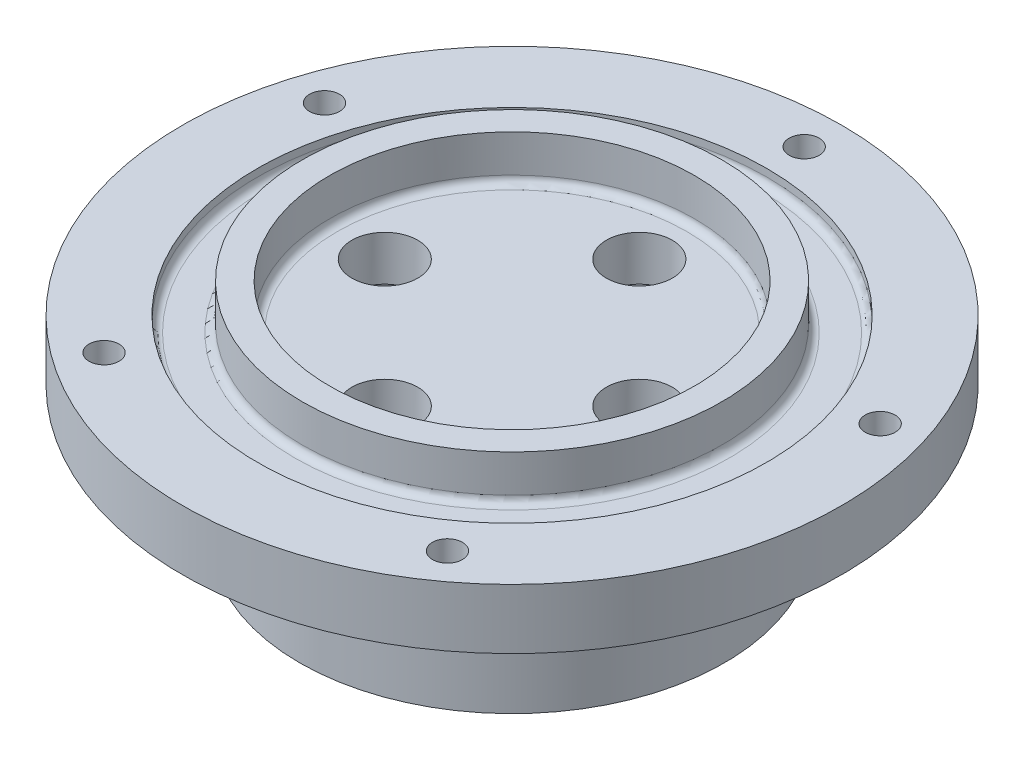
ISO-10303-21;
HEADER;
FILE_DESCRIPTION(('STEP AP214'),'2;1');
FILE_NAME('part.step','',(''),(''),'','','');
FILE_SCHEMA(('AUTOMOTIVE_DESIGN { 1 0 10303 214 1 1 1 1 }'));
ENDSEC;
DATA;
#1=APPLICATION_CONTEXT('core data for automotive mechanical design processes');
#2=APPLICATION_PROTOCOL_DEFINITION('international standard','automotive_design',2000,#1);
#3=PRODUCT_CONTEXT('',#1,'mechanical');
#4=PRODUCT('Part','Part','',(#3));
#5=PRODUCT_RELATED_PRODUCT_CATEGORY('part','',(#4));
#6=PRODUCT_DEFINITION_FORMATION('','',#4);
#7=PRODUCT_DEFINITION_CONTEXT('part definition',#1,'design');
#8=PRODUCT_DEFINITION('design','',#6,#7);
#9=PRODUCT_DEFINITION_SHAPE('','',#8);
#10=(LENGTH_UNIT() NAMED_UNIT(*) SI_UNIT(.MILLI.,.METRE.));
#11=(NAMED_UNIT(*) PLANE_ANGLE_UNIT() SI_UNIT($,.RADIAN.));
#12=(NAMED_UNIT(*) SI_UNIT($,.STERADIAN.) SOLID_ANGLE_UNIT());
#13=UNCERTAINTY_MEASURE_WITH_UNIT(LENGTH_MEASURE(1.E-05),#10,'distance_accuracy_value','');
#14=(GEOMETRIC_REPRESENTATION_CONTEXT(3) GLOBAL_UNCERTAINTY_ASSIGNED_CONTEXT((#13)) GLOBAL_UNIT_ASSIGNED_CONTEXT((#10,
#11,#12)) REPRESENTATION_CONTEXT('',''));
#15=CARTESIAN_POINT('',(0.,0.,0.));
#16=DIRECTION('',(0.,0.,1.));
#17=DIRECTION('',(1.,0.,0.));
#18=AXIS2_PLACEMENT_3D('',#15,#16,#17);
#19=CARTESIAN_POINT('',(-22.51075,-14.2875,-1.57191727096726E-13));
#20=DIRECTION('',(0.,-1.,0.));
#21=DIRECTION('',(0.,0.,-1.));
#22=AXIS2_PLACEMENT_3D('',#19,#20,#21);
#23=PLANE('',#22);
#24=CARTESIAN_POINT('',(0.,-14.2875,0.));
#25=DIRECTION('',(0.,-1.,0.));
#26=DIRECTION('',(0.,0.,-1.));
#27=AXIS2_PLACEMENT_3D('',#24,#25,#26);
#28=CIRCLE('',#27,22.51075);
#29=CARTESIAN_POINT('',(0.,-14.2875,-22.51075));
#30=VERTEX_POINT('',#29);
#31=EDGE_CURVE('E131',#30,#30,#28,.T.);
#32=ORIENTED_EDGE('',*,*,#31,.T.);
#33=EDGE_LOOP('',(#32));
#34=FACE_BOUND('',#33,.T.);
#35=CARTESIAN_POINT('',(0.,-14.2875,0.));
#36=DIRECTION('',(0.,-1.,0.));
#37=DIRECTION('',(0.,0.,-1.));
#38=AXIS2_PLACEMENT_3D('',#35,#36,#37);
#39=CIRCLE('',#38,19.33575);
#40=CARTESIAN_POINT('',(0.,-14.2875,-19.33575));
#41=VERTEX_POINT('',#40);
#42=EDGE_CURVE('E78',#41,#41,#39,.T.);
#43=ORIENTED_EDGE('',*,*,#42,.F.);
#44=EDGE_LOOP('',(#43));
#45=FACE_BOUND('',#44,.T.);
#46=ADVANCED_FACE('F36',(#34,#45),#23,.T.);
#47=CARTESIAN_POINT('',(0.,0.,0.));
#48=DIRECTION('',(0.,-1.,0.));
#49=DIRECTION('',(0.,0.,-1.));
#50=AXIS2_PLACEMENT_3D('',#47,#48,#49);
#51=CYLINDRICAL_SURFACE('',#50,19.33575);
#52=CARTESIAN_POINT('',(0.,-0.79375,0.));
#53=DIRECTION('',(0.,-1.,0.));
#54=DIRECTION('',(0.,0.,-1.));
#55=AXIS2_PLACEMENT_3D('',#52,#53,#54);
#56=CIRCLE('',#55,19.33575);
#57=CARTESIAN_POINT('',(0.,-0.79375,-19.33575));
#58=VERTEX_POINT('',#57);
#59=EDGE_CURVE('E70',#58,#58,#56,.F.);
#60=ORIENTED_EDGE('',*,*,#59,.T.);
#61=EDGE_LOOP('',(#60));
#62=FACE_BOUND('',#61,.T.);
#63=ORIENTED_EDGE('',*,*,#42,.T.);
#64=EDGE_LOOP('',(#63));
#65=FACE_BOUND('',#64,.T.);
#66=ADVANCED_FACE('F222',(#62,#65),#51,.F.);
#67=CARTESIAN_POINT('',(-19.33575,0.,-1.35020820595072E-13));
#68=DIRECTION('',(0.,-1.,0.));
#69=DIRECTION('',(0.,0.,-1.));
#70=AXIS2_PLACEMENT_3D('',#67,#68,#69);
#71=PLANE('',#70);
#72=CARTESIAN_POINT('',(0.,0.,0.));
#73=DIRECTION('',(0.,-1.,0.));
#74=DIRECTION('',(0.,0.,-1.));
#75=AXIS2_PLACEMENT_3D('',#72,#73,#74);
#76=CIRCLE('',#75,18.542);
#77=CARTESIAN_POINT('',(0.,0.,-18.542));
#78=VERTEX_POINT('',#77);
#79=EDGE_CURVE('E74',#78,#78,#76,.T.);
#80=ORIENTED_EDGE('',*,*,#79,.T.);
#81=EDGE_LOOP('',(#80));
#82=FACE_BOUND('',#81,.T.);
#83=CARTESIAN_POINT('',(0.,0.,-13.4874));
#84=DIRECTION('',(0.,-1.,0.));
#85=DIRECTION('',(0.,0.,-1.));
#86=AXIS2_PLACEMENT_3D('',#83,#84,#85);
#87=CIRCLE('',#86,3.4925);
#88=CARTESIAN_POINT('',(0.,0.,-16.9799));
#89=VERTEX_POINT('',#88);
#90=EDGE_CURVE('E158',#89,#89,#87,.T.);
#91=ORIENTED_EDGE('',*,*,#90,.F.);
#92=EDGE_LOOP('',(#91));
#93=FACE_BOUND('',#92,.T.);
#94=CARTESIAN_POINT('',(13.4874,0.,0.));
#95=DIRECTION('',(0.,-1.,0.));
#96=DIRECTION('',(0.,0.,-1.));
#97=AXIS2_PLACEMENT_3D('',#94,#95,#96);
#98=CIRCLE('',#97,3.4925);
#99=CARTESIAN_POINT('',(13.4874,0.,-3.4925));
#100=VERTEX_POINT('',#99);
#101=EDGE_CURVE('E150',#100,#100,#98,.T.);
#102=ORIENTED_EDGE('',*,*,#101,.F.);
#103=EDGE_LOOP('',(#102));
#104=FACE_BOUND('',#103,.T.);
#105=CARTESIAN_POINT('',(0.,0.,13.4874));
#106=DIRECTION('',(0.,-1.,0.));
#107=DIRECTION('',(0.,0.,-1.));
#108=AXIS2_PLACEMENT_3D('',#105,#106,#107);
#109=CIRCLE('',#108,3.4925);
#110=CARTESIAN_POINT('',(0.,0.,9.9949));
#111=VERTEX_POINT('',#110);
#112=EDGE_CURVE('E143',#111,#111,#109,.T.);
#113=ORIENTED_EDGE('',*,*,#112,.F.);
#114=EDGE_LOOP('',(#113));
#115=FACE_BOUND('',#114,.T.);
#116=CARTESIAN_POINT('',(-13.4874,0.,0.));
#117=DIRECTION('',(0.,-1.,0.));
#118=DIRECTION('',(0.,0.,-1.));
#119=AXIS2_PLACEMENT_3D('',#116,#117,#118);
#120=CIRCLE('',#119,3.4925);
#121=CARTESIAN_POINT('',(-13.4874,0.,-3.4925));
#122=VERTEX_POINT('',#121);
#123=EDGE_CURVE('E135',#122,#122,#120,.T.);
#124=ORIENTED_EDGE('',*,*,#123,.F.);
#125=EDGE_LOOP('',(#124));
#126=FACE_BOUND('',#125,.T.);
#127=ADVANCED_FACE('F227',(#82,#93,#104,#115,#126),#71,.T.);
#128=CARTESIAN_POINT('',(0.,4.7625,0.));
#129=DIRECTION('',(0.,1.,0.));
#130=DIRECTION('',(0.,0.,1.));
#131=AXIS2_PLACEMENT_3D('',#128,#129,#130);
#132=PLANE('',#131);
#133=CARTESIAN_POINT('',(0.,4.7625,0.));
#134=DIRECTION('',(0.,1.,0.));
#135=DIRECTION('',(0.,0.,1.));
#136=AXIS2_PLACEMENT_3D('',#133,#134,#135);
#137=CIRCLE('',#136,18.542);
#138=CARTESIAN_POINT('',(0.,4.7625,18.542));
#139=VERTEX_POINT('',#138);
#140=EDGE_CURVE('E62',#139,#139,#137,.T.);
#141=ORIENTED_EDGE('',*,*,#140,.T.);
#142=EDGE_LOOP('',(#141));
#143=FACE_BOUND('',#142,.T.);
#144=CARTESIAN_POINT('',(0.,4.7625,-13.4874));
#145=DIRECTION('',(0.,1.,0.));
#146=DIRECTION('',(0.,0.,1.));
#147=AXIS2_PLACEMENT_3D('',#144,#145,#146);
#148=CIRCLE('',#147,3.4925);
#149=CARTESIAN_POINT('',(0.,4.7625,-9.9949));
#150=VERTEX_POINT('',#149);
#151=EDGE_CURVE('E104',#150,#150,#148,.T.);
#152=ORIENTED_EDGE('',*,*,#151,.F.);
#153=EDGE_LOOP('',(#152));
#154=FACE_BOUND('',#153,.T.);
#155=CARTESIAN_POINT('',(13.4874,4.7625,0.));
#156=DIRECTION('',(0.,1.,0.));
#157=DIRECTION('',(0.,0.,1.));
#158=AXIS2_PLACEMENT_3D('',#155,#156,#157);
#159=CIRCLE('',#158,3.4925);
#160=CARTESIAN_POINT('',(13.4874,4.7625,3.4925));
#161=VERTEX_POINT('',#160);
#162=EDGE_CURVE('E154',#161,#161,#159,.T.);
#163=ORIENTED_EDGE('',*,*,#162,.F.);
#164=EDGE_LOOP('',(#163));
#165=FACE_BOUND('',#164,.T.);
#166=CARTESIAN_POINT('',(0.,4.7625,13.4874));
#167=DIRECTION('',(0.,1.,0.));
#168=DIRECTION('',(0.,0.,1.));
#169=AXIS2_PLACEMENT_3D('',#166,#167,#168);
#170=CIRCLE('',#169,3.4925);
#171=CARTESIAN_POINT('',(0.,4.7625,16.9799));
#172=VERTEX_POINT('',#171);
#173=EDGE_CURVE('E147',#172,#172,#170,.T.);
#174=ORIENTED_EDGE('',*,*,#173,.F.);
#175=EDGE_LOOP('',(#174));
#176=FACE_BOUND('',#175,.T.);
#177=CARTESIAN_POINT('',(-13.4874,4.7625,0.));
#178=DIRECTION('',(0.,1.,0.));
#179=DIRECTION('',(0.,0.,1.));
#180=AXIS2_PLACEMENT_3D('',#177,#178,#179);
#181=CIRCLE('',#180,3.4925);
#182=CARTESIAN_POINT('',(-13.4874,4.7625,3.4925));
#183=VERTEX_POINT('',#182);
#184=EDGE_CURVE('E139',#183,#183,#181,.T.);
#185=ORIENTED_EDGE('',*,*,#184,.F.);
#186=EDGE_LOOP('',(#185));
#187=FACE_BOUND('',#186,.T.);
#188=ADVANCED_FACE('F233',(#143,#154,#165,#176,#187),#132,.T.);
#189=CARTESIAN_POINT('',(0.,0.,0.));
#190=DIRECTION('',(0.,-1.,0.));
#191=DIRECTION('',(0.,0.,-1.));
#192=AXIS2_PLACEMENT_3D('',#189,#190,#191);
#193=CYLINDRICAL_SURFACE('',#192,19.33575);
#194=CARTESIAN_POINT('',(0.,5.55625,0.));
#195=DIRECTION('',(0.,1.,0.));
#196=DIRECTION('',(0.,0.,1.));
#197=AXIS2_PLACEMENT_3D('',#194,#195,#196);
#198=CIRCLE('',#197,19.33575);
#199=CARTESIAN_POINT('',(0.,5.55625,19.33575));
#200=VERTEX_POINT('',#199);
#201=EDGE_CURVE('E66',#200,#200,#198,.F.);
#202=ORIENTED_EDGE('',*,*,#201,.T.);
#203=EDGE_LOOP('',(#202));
#204=FACE_BOUND('',#203,.T.);
#205=CARTESIAN_POINT('',(0.,9.525,0.));
#206=DIRECTION('',(0.,-1.,0.));
#207=DIRECTION('',(0.,0.,-1.));
#208=AXIS2_PLACEMENT_3D('',#205,#206,#207);
#209=CIRCLE('',#208,19.33575);
#210=CARTESIAN_POINT('',(0.,9.525,-19.33575));
#211=VERTEX_POINT('',#210);
#212=EDGE_CURVE('E108',#211,#211,#209,.T.);
#213=ORIENTED_EDGE('',*,*,#212,.F.);
#214=EDGE_LOOP('',(#213));
#215=FACE_BOUND('',#214,.T.);
#216=ADVANCED_FACE('F272',(#204,#215),#193,.F.);
#217=CARTESIAN_POINT('',(-19.33575,9.525,-1.35020820595072E-13));
#218=DIRECTION('',(0.,1.,0.));
#219=DIRECTION('',(0.,0.,1.));
#220=AXIS2_PLACEMENT_3D('',#217,#218,#219);
#221=PLANE('',#220);
#222=ORIENTED_EDGE('',*,*,#212,.T.);
#223=EDGE_LOOP('',(#222));
#224=FACE_BOUND('',#223,.T.);
#225=CARTESIAN_POINT('',(0.,9.525,0.));
#226=DIRECTION('',(0.,-1.,0.));
#227=DIRECTION('',(0.,0.,-1.));
#228=AXIS2_PLACEMENT_3D('',#225,#226,#227);
#229=CIRCLE('',#228,22.225);
#230=CARTESIAN_POINT('',(0.,9.525,-22.225));
#231=VERTEX_POINT('',#230);
#232=EDGE_CURVE('E112',#231,#231,#229,.T.);
#233=ORIENTED_EDGE('',*,*,#232,.F.);
#234=EDGE_LOOP('',(#233));
#235=FACE_BOUND('',#234,.T.);
#236=ADVANCED_FACE('F267',(#224,#235),#221,.T.);
#237=CARTESIAN_POINT('',(0.,0.,0.));
#238=DIRECTION('',(0.,-1.,0.));
#239=DIRECTION('',(0.,0.,-1.));
#240=AXIS2_PLACEMENT_3D('',#237,#238,#239);
#241=CYLINDRICAL_SURFACE('',#240,22.225);
#242=CARTESIAN_POINT('',(0.,5.55625,0.));
#243=DIRECTION('',(0.,1.,0.));
#244=DIRECTION('',(0.,0.,1.));
#245=AXIS2_PLACEMENT_3D('',#242,#243,#244);
#246=CIRCLE('',#245,22.225);
#247=CARTESIAN_POINT('',(0.,5.55625,22.225));
#248=VERTEX_POINT('',#247);
#249=EDGE_CURVE('E44',#248,#248,#246,.T.);
#250=ORIENTED_EDGE('',*,*,#249,.T.);
#251=EDGE_LOOP('',(#250));
#252=FACE_BOUND('',#251,.T.);
#253=ORIENTED_EDGE('',*,*,#232,.T.);
#254=EDGE_LOOP('',(#253));
#255=FACE_BOUND('',#254,.T.);
#256=ADVANCED_FACE('F258',(#252,#255),#241,.T.);
#257=CARTESIAN_POINT('',(-22.225,4.7625,-1.55196345511577E-13));
#258=DIRECTION('',(0.,1.,0.));
#259=DIRECTION('',(0.,0.,1.));
#260=AXIS2_PLACEMENT_3D('',#257,#258,#259);
#261=PLANE('',#260);
#262=CARTESIAN_POINT('',(0.,4.7625,0.));
#263=DIRECTION('',(0.,1.,0.));
#264=DIRECTION('',(0.,0.,1.));
#265=AXIS2_PLACEMENT_3D('',#262,#263,#264);
#266=CIRCLE('',#265,23.01875);
#267=CARTESIAN_POINT('',(0.,4.7625,23.01875));
#268=VERTEX_POINT('',#267);
#269=EDGE_CURVE('E51',#268,#268,#266,.F.);
#270=ORIENTED_EDGE('',*,*,#269,.T.);
#271=EDGE_LOOP('',(#270));
#272=FACE_BOUND('',#271,.T.);
#273=CARTESIAN_POINT('',(0.,4.7625,0.));
#274=DIRECTION('',(0.,1.,0.));
#275=DIRECTION('',(0.,0.,1.));
#276=AXIS2_PLACEMENT_3D('',#273,#274,#275);
#277=CIRCLE('',#276,26.19375);
#278=CARTESIAN_POINT('',(0.,4.7625,26.19375));
#279=VERTEX_POINT('',#278);
#280=EDGE_CURVE('E57',#279,#279,#277,.T.);
#281=ORIENTED_EDGE('',*,*,#280,.T.);
#282=EDGE_LOOP('',(#281));
#283=FACE_BOUND('',#282,.T.);
#284=ADVANCED_FACE('F255',(#272,#283),#261,.T.);
#285=CARTESIAN_POINT('',(0.,0.,0.));
#286=DIRECTION('',(0.,-1.,0.));
#287=DIRECTION('',(0.,0.,-1.));
#288=AXIS2_PLACEMENT_3D('',#285,#286,#287);
#289=CYLINDRICAL_SURFACE('',#288,26.9875);
#290=CARTESIAN_POINT('',(0.,5.55625,0.));
#291=DIRECTION('',(0.,1.,0.));
#292=DIRECTION('',(0.,0.,1.));
#293=AXIS2_PLACEMENT_3D('',#290,#291,#292);
#294=CIRCLE('',#293,26.9875);
#295=CARTESIAN_POINT('',(0.,5.55625,26.9875));
#296=VERTEX_POINT('',#295);
#297=EDGE_CURVE('E10',#296,#296,#294,.F.);
#298=ORIENTED_EDGE('',*,*,#297,.T.);
#299=EDGE_LOOP('',(#298));
#300=FACE_BOUND('',#299,.T.);
#301=CARTESIAN_POINT('',(0.,6.35,0.));
#302=DIRECTION('',(0.,-1.,0.));
#303=DIRECTION('',(0.,0.,-1.));
#304=AXIS2_PLACEMENT_3D('',#301,#302,#303);
#305=CIRCLE('',#304,26.9875);
#306=CARTESIAN_POINT('',(0.,6.35,-26.9875));
#307=VERTEX_POINT('',#306);
#308=EDGE_CURVE('E116',#307,#307,#305,.T.);
#309=ORIENTED_EDGE('',*,*,#308,.F.);
#310=EDGE_LOOP('',(#309));
#311=FACE_BOUND('',#310,.T.);
#312=ADVANCED_FACE('F187',(#300,#311),#289,.F.);
#313=CARTESIAN_POINT('',(-26.9875,6.35,-1.88452705264058E-13));
#314=DIRECTION('',(0.,1.,0.));
#315=DIRECTION('',(0.,0.,1.));
#316=AXIS2_PLACEMENT_3D('',#313,#314,#315);
#317=PLANE('',#316);
#318=CARTESIAN_POINT('',(-29.4411432825617,6.35,-9.5660073321198));
#319=DIRECTION('',(0.,1.,0.));
#320=DIRECTION('',(0.95105651629515,0.,0.309016994374958));
#321=AXIS2_PLACEMENT_3D('',#318,#319,#320);
#322=CIRCLE('',#321,1.5875);
#323=CARTESIAN_POINT('',(-27.9313410629432,6.35,-9.07544285354955));
#324=VERTEX_POINT('',#323);
#325=EDGE_CURVE('E84',#324,#324,#322,.T.);
#326=ORIENTED_EDGE('',*,*,#325,.F.);
#327=EDGE_LOOP('',(#326));
#328=FACE_BOUND('',#327,.T.);
#329=CARTESIAN_POINT('',(-18.1956272162791,6.35,25.0441323321193));
#330=DIRECTION('',(0.,1.,0.));
#331=DIRECTION('',(0.58778525229248,0.,-0.809016994374942));
#332=AXIS2_PLACEMENT_3D('',#329,#330,#331);
#333=CIRCLE('',#332,1.5875);
#334=CARTESIAN_POINT('',(-17.2625181282648,6.35,23.7598178535491));
#335=VERTEX_POINT('',#334);
#336=EDGE_CURVE('E83',#335,#335,#333,.T.);
#337=ORIENTED_EDGE('',*,*,#336,.F.);
#338=EDGE_LOOP('',(#337));
#339=FACE_BOUND('',#338,.T.);
#340=CARTESIAN_POINT('',(18.1956272162787,6.35,25.0441323321196));
#341=DIRECTION('',(0.,1.,0.));
#342=DIRECTION('',(-0.587785252292469,0.,-0.809016994374951));
#343=AXIS2_PLACEMENT_3D('',#340,#341,#342);
#344=CIRCLE('',#343,1.5875);
#345=CARTESIAN_POINT('',(17.2625181282644,6.35,23.7598178535493));
#346=VERTEX_POINT('',#345);
#347=EDGE_CURVE('E89',#346,#346,#344,.T.);
#348=ORIENTED_EDGE('',*,*,#347,.F.);
#349=EDGE_LOOP('',(#348));
#350=FACE_BOUND('',#349,.T.);
#351=CARTESIAN_POINT('',(29.4411432825619,6.35,-9.56600733211938));
#352=DIRECTION('',(0.,1.,0.));
#353=DIRECTION('',(-0.951056516295155,0.,0.309016994374945));
#354=AXIS2_PLACEMENT_3D('',#351,#352,#353);
#355=CIRCLE('',#354,1.5875);
#356=CARTESIAN_POINT('',(27.9313410629433,6.35,-9.07544285354916));
#357=VERTEX_POINT('',#356);
#358=EDGE_CURVE('E94',#357,#357,#355,.T.);
#359=ORIENTED_EDGE('',*,*,#358,.F.);
#360=EDGE_LOOP('',(#359));
#361=FACE_BOUND('',#360,.T.);
#362=CARTESIAN_POINT('',(0.,6.35,-30.95625));
#363=DIRECTION('',(0.,1.,0.));
#364=DIRECTION('',(0.,0.,1.));
#365=AXIS2_PLACEMENT_3D('',#362,#363,#364);
#366=CIRCLE('',#365,1.5875);
#367=CARTESIAN_POINT('',(0.,6.35,-29.36875));
#368=VERTEX_POINT('',#367);
#369=EDGE_CURVE('E99',#368,#368,#366,.T.);
#370=ORIENTED_EDGE('',*,*,#369,.F.);
#371=EDGE_LOOP('',(#370));
#372=FACE_BOUND('',#371,.T.);
#373=ORIENTED_EDGE('',*,*,#308,.T.);
#374=EDGE_LOOP('',(#373));
#375=FACE_BOUND('',#374,.T.);
#376=CARTESIAN_POINT('',(0.,6.35,0.));
#377=DIRECTION('',(0.,-1.,0.));
#378=DIRECTION('',(0.,0.,-1.));
#379=AXIS2_PLACEMENT_3D('',#376,#377,#378);
#380=CIRCLE('',#379,34.925);
#381=CARTESIAN_POINT('',(0.,6.35,-34.925));
#382=VERTEX_POINT('',#381);
#383=EDGE_CURVE('E119',#382,#382,#380,.T.);
#384=ORIENTED_EDGE('',*,*,#383,.F.);
#385=EDGE_LOOP('',(#384));
#386=FACE_BOUND('',#385,.T.);
#387=ADVANCED_FACE('F183',(#328,#339,#350,#361,#372,#375,#386),#317,.T.);
#388=CARTESIAN_POINT('',(0.,0.,0.));
#389=DIRECTION('',(0.,-1.,0.));
#390=DIRECTION('',(0.,0.,-1.));
#391=AXIS2_PLACEMENT_3D('',#388,#389,#390);
#392=CYLINDRICAL_SURFACE('',#391,34.925);
#393=ORIENTED_EDGE('',*,*,#383,.T.);
#394=EDGE_LOOP('',(#393));
#395=FACE_BOUND('',#394,.T.);
#396=CARTESIAN_POINT('',(0.,0.,0.));
#397=DIRECTION('',(0.,-1.,0.));
#398=DIRECTION('',(0.,0.,-1.));
#399=AXIS2_PLACEMENT_3D('',#396,#397,#398);
#400=CIRCLE('',#399,34.925);
#401=CARTESIAN_POINT('',(0.,0.,-34.925));
#402=VERTEX_POINT('',#401);
#403=EDGE_CURVE('E123',#402,#402,#400,.T.);
#404=ORIENTED_EDGE('',*,*,#403,.F.);
#405=EDGE_LOOP('',(#404));
#406=FACE_BOUND('',#405,.T.);
#407=ADVANCED_FACE('F186',(#395,#406),#392,.T.);
#408=CARTESIAN_POINT('',(-34.925,0.,-2.43879971518193E-13));
#409=DIRECTION('',(0.,-1.,0.));
#410=DIRECTION('',(0.,0.,-1.));
#411=AXIS2_PLACEMENT_3D('',#408,#409,#410);
#412=PLANE('',#411);
#413=CARTESIAN_POINT('',(-29.4411432825617,0.,-9.5660073321198));
#414=DIRECTION('',(0.,-1.,0.));
#415=DIRECTION('',(0.,0.,-1.));
#416=AXIS2_PLACEMENT_3D('',#413,#414,#415);
#417=CIRCLE('',#416,1.5875);
#418=CARTESIAN_POINT('',(-29.4411432825617,0.,-11.1535073321198));
#419=VERTEX_POINT('',#418);
#420=EDGE_CURVE('E79',#419,#419,#417,.T.);
#421=ORIENTED_EDGE('',*,*,#420,.F.);
#422=EDGE_LOOP('',(#421));
#423=FACE_BOUND('',#422,.T.);
#424=CARTESIAN_POINT('',(-18.1956272162791,0.,25.0441323321193));
#425=DIRECTION('',(0.,-1.,0.));
#426=DIRECTION('',(0.,0.,-1.));
#427=AXIS2_PLACEMENT_3D('',#424,#425,#426);
#428=CIRCLE('',#427,1.5875);
#429=CARTESIAN_POINT('',(-18.1956272162791,0.,23.4566323321193));
#430=VERTEX_POINT('',#429);
#431=EDGE_CURVE('E85',#430,#430,#428,.T.);
#432=ORIENTED_EDGE('',*,*,#431,.F.);
#433=EDGE_LOOP('',(#432));
#434=FACE_BOUND('',#433,.T.);
#435=CARTESIAN_POINT('',(18.1956272162787,0.,25.0441323321196));
#436=DIRECTION('',(0.,-1.,0.));
#437=DIRECTION('',(0.,0.,-1.));
#438=AXIS2_PLACEMENT_3D('',#435,#436,#437);
#439=CIRCLE('',#438,1.5875);
#440=CARTESIAN_POINT('',(18.1956272162787,0.,23.4566323321196));
#441=VERTEX_POINT('',#440);
#442=EDGE_CURVE('E90',#441,#441,#439,.T.);
#443=ORIENTED_EDGE('',*,*,#442,.F.);
#444=EDGE_LOOP('',(#443));
#445=FACE_BOUND('',#444,.T.);
#446=CARTESIAN_POINT('',(29.4411432825619,0.,-9.56600733211938));
#447=DIRECTION('',(0.,-1.,0.));
#448=DIRECTION('',(0.,0.,-1.));
#449=AXIS2_PLACEMENT_3D('',#446,#447,#448);
#450=CIRCLE('',#449,1.5875);
#451=CARTESIAN_POINT('',(29.4411432825619,0.,-11.1535073321194));
#452=VERTEX_POINT('',#451);
#453=EDGE_CURVE('E95',#452,#452,#450,.T.);
#454=ORIENTED_EDGE('',*,*,#453,.F.);
#455=EDGE_LOOP('',(#454));
#456=FACE_BOUND('',#455,.T.);
#457=CARTESIAN_POINT('',(0.,0.,-30.95625));
#458=DIRECTION('',(0.,-1.,0.));
#459=DIRECTION('',(0.,0.,-1.));
#460=AXIS2_PLACEMENT_3D('',#457,#458,#459);
#461=CIRCLE('',#460,1.5875);
#462=CARTESIAN_POINT('',(0.,0.,-32.54375));
#463=VERTEX_POINT('',#462);
#464=EDGE_CURVE('E100',#463,#463,#461,.T.);
#465=ORIENTED_EDGE('',*,*,#464,.F.);
#466=EDGE_LOOP('',(#465));
#467=FACE_BOUND('',#466,.T.);
#468=ORIENTED_EDGE('',*,*,#403,.T.);
#469=EDGE_LOOP('',(#468));
#470=FACE_BOUND('',#469,.T.);
#471=CARTESIAN_POINT('',(0.,0.,0.));
#472=DIRECTION('',(0.,-1.,0.));
#473=DIRECTION('',(0.,0.,-1.));
#474=AXIS2_PLACEMENT_3D('',#471,#472,#473);
#475=CIRCLE('',#474,22.51075);
#476=CARTESIAN_POINT('',(0.,0.,-22.51075));
#477=VERTEX_POINT('',#476);
#478=EDGE_CURVE('E127',#477,#477,#475,.T.);
#479=ORIENTED_EDGE('',*,*,#478,.F.);
#480=EDGE_LOOP('',(#479));
#481=FACE_BOUND('',#480,.T.);
#482=ADVANCED_FACE('F203',(#423,#434,#445,#456,#467,#470,#481),#412,.T.);
#483=CARTESIAN_POINT('',(0.,0.,0.));
#484=DIRECTION('',(0.,-1.,0.));
#485=DIRECTION('',(0.,0.,-1.));
#486=AXIS2_PLACEMENT_3D('',#483,#484,#485);
#487=CYLINDRICAL_SURFACE('',#486,22.51075);
#488=ORIENTED_EDGE('',*,*,#478,.T.);
#489=EDGE_LOOP('',(#488));
#490=FACE_BOUND('',#489,.T.);
#491=ORIENTED_EDGE('',*,*,#31,.F.);
#492=EDGE_LOOP('',(#491));
#493=FACE_BOUND('',#492,.T.);
#494=ADVANCED_FACE('F209',(#490,#493),#487,.T.);
#495=CARTESIAN_POINT('',(-13.4874,-14.2875,0.));
#496=DIRECTION('',(0.,1.,0.));
#497=DIRECTION('',(0.,0.,1.));
#498=AXIS2_PLACEMENT_3D('',#495,#496,#497);
#499=CYLINDRICAL_SURFACE('',#498,3.4925);
#500=ORIENTED_EDGE('',*,*,#123,.T.);
#501=EDGE_LOOP('',(#500));
#502=FACE_BOUND('',#501,.T.);
#503=ORIENTED_EDGE('',*,*,#184,.T.);
#504=EDGE_LOOP('',(#503));
#505=FACE_BOUND('',#504,.T.);
#506=ADVANCED_FACE('F216',(#502,#505),#499,.F.);
#507=CARTESIAN_POINT('',(0.,-14.2875,13.4874));
#508=DIRECTION('',(0.,1.,0.));
#509=DIRECTION('',(0.,0.,1.));
#510=AXIS2_PLACEMENT_3D('',#507,#508,#509);
#511=CYLINDRICAL_SURFACE('',#510,3.4925);
#512=ORIENTED_EDGE('',*,*,#112,.T.);
#513=EDGE_LOOP('',(#512));
#514=FACE_BOUND('',#513,.T.);
#515=ORIENTED_EDGE('',*,*,#173,.T.);
#516=EDGE_LOOP('',(#515));
#517=FACE_BOUND('',#516,.T.);
#518=ADVANCED_FACE('F291',(#514,#517),#511,.F.);
#519=CARTESIAN_POINT('',(13.4874,-14.2875,0.));
#520=DIRECTION('',(0.,1.,0.));
#521=DIRECTION('',(0.,0.,1.));
#522=AXIS2_PLACEMENT_3D('',#519,#520,#521);
#523=CYLINDRICAL_SURFACE('',#522,3.4925);
#524=ORIENTED_EDGE('',*,*,#101,.T.);
#525=EDGE_LOOP('',(#524));
#526=FACE_BOUND('',#525,.T.);
#527=ORIENTED_EDGE('',*,*,#162,.T.);
#528=EDGE_LOOP('',(#527));
#529=FACE_BOUND('',#528,.T.);
#530=ADVANCED_FACE('F297',(#526,#529),#523,.F.);
#531=CARTESIAN_POINT('',(0.,-14.2875,-13.4874));
#532=DIRECTION('',(0.,1.,0.));
#533=DIRECTION('',(0.,0.,1.));
#534=AXIS2_PLACEMENT_3D('',#531,#532,#533);
#535=CYLINDRICAL_SURFACE('',#534,3.4925);
#536=ORIENTED_EDGE('',*,*,#90,.T.);
#537=EDGE_LOOP('',(#536));
#538=FACE_BOUND('',#537,.T.);
#539=ORIENTED_EDGE('',*,*,#151,.T.);
#540=EDGE_LOOP('',(#539));
#541=FACE_BOUND('',#540,.T.);
#542=ADVANCED_FACE('F303',(#538,#541),#535,.F.);
#543=CARTESIAN_POINT('',(0.,-14.2875,-30.95625));
#544=DIRECTION('',(0.,1.,0.));
#545=DIRECTION('',(0.,0.,1.));
#546=AXIS2_PLACEMENT_3D('',#543,#544,#545);
#547=CYLINDRICAL_SURFACE('',#546,1.5875);
#548=ORIENTED_EDGE('',*,*,#464,.T.);
#549=EDGE_LOOP('',(#548));
#550=FACE_BOUND('',#549,.T.);
#551=ORIENTED_EDGE('',*,*,#369,.T.);
#552=EDGE_LOOP('',(#551));
#553=FACE_BOUND('',#552,.T.);
#554=ADVANCED_FACE('F307',(#550,#553),#547,.F.);
#555=CARTESIAN_POINT('',(29.4411432825619,-14.2875,-9.56600733211938));
#556=DIRECTION('',(0.,1.,0.));
#557=DIRECTION('',(0.,0.,1.));
#558=AXIS2_PLACEMENT_3D('',#555,#556,#557);
#559=CYLINDRICAL_SURFACE('',#558,1.5875);
#560=ORIENTED_EDGE('',*,*,#453,.T.);
#561=EDGE_LOOP('',(#560));
#562=FACE_BOUND('',#561,.T.);
#563=ORIENTED_EDGE('',*,*,#358,.T.);
#564=EDGE_LOOP('',(#563));
#565=FACE_BOUND('',#564,.T.);
#566=ADVANCED_FACE('F311',(#562,#565),#559,.F.);
#567=CARTESIAN_POINT('',(18.1956272162787,-14.2875,25.0441323321196));
#568=DIRECTION('',(0.,1.,0.));
#569=DIRECTION('',(0.,0.,1.));
#570=AXIS2_PLACEMENT_3D('',#567,#568,#569);
#571=CYLINDRICAL_SURFACE('',#570,1.5875);
#572=ORIENTED_EDGE('',*,*,#442,.T.);
#573=EDGE_LOOP('',(#572));
#574=FACE_BOUND('',#573,.T.);
#575=ORIENTED_EDGE('',*,*,#347,.T.);
#576=EDGE_LOOP('',(#575));
#577=FACE_BOUND('',#576,.T.);
#578=ADVANCED_FACE('F315',(#574,#577),#571,.F.);
#579=CARTESIAN_POINT('',(-18.1956272162791,-14.2875,25.0441323321193));
#580=DIRECTION('',(0.,1.,0.));
#581=DIRECTION('',(0.,0.,1.));
#582=AXIS2_PLACEMENT_3D('',#579,#580,#581);
#583=CYLINDRICAL_SURFACE('',#582,1.5875);
#584=ORIENTED_EDGE('',*,*,#431,.T.);
#585=EDGE_LOOP('',(#584));
#586=FACE_BOUND('',#585,.T.);
#587=ORIENTED_EDGE('',*,*,#336,.T.);
#588=EDGE_LOOP('',(#587));
#589=FACE_BOUND('',#588,.T.);
#590=ADVANCED_FACE('F319',(#586,#589),#583,.F.);
#591=CARTESIAN_POINT('',(-29.4411432825617,-14.2875,-9.5660073321198));
#592=DIRECTION('',(0.,1.,0.));
#593=DIRECTION('',(0.,0.,1.));
#594=AXIS2_PLACEMENT_3D('',#591,#592,#593);
#595=CYLINDRICAL_SURFACE('',#594,1.5875);
#596=ORIENTED_EDGE('',*,*,#420,.T.);
#597=EDGE_LOOP('',(#596));
#598=FACE_BOUND('',#597,.T.);
#599=ORIENTED_EDGE('',*,*,#325,.T.);
#600=EDGE_LOOP('',(#599));
#601=FACE_BOUND('',#600,.T.);
#602=ADVANCED_FACE('F181',(#598,#601),#595,.F.);
#603=CARTESIAN_POINT('',(0.,-0.79375,0.));
#604=DIRECTION('',(0.,-1.,0.));
#605=DIRECTION('',(0.,0.,-1.));
#606=AXIS2_PLACEMENT_3D('',#603,#604,#605);
#607=TOROIDAL_SURFACE('',#606,18.542,0.79375);
#608=ORIENTED_EDGE('',*,*,#59,.F.);
#609=EDGE_LOOP('',(#608));
#610=FACE_BOUND('',#609,.T.);
#611=ORIENTED_EDGE('',*,*,#79,.F.);
#612=EDGE_LOOP('',(#611));
#613=FACE_BOUND('',#612,.T.);
#614=ADVANCED_FACE('F238',(#610,#613),#607,.F.);
#615=CARTESIAN_POINT('',(0.,5.55625,0.));
#616=DIRECTION('',(0.,1.,0.));
#617=DIRECTION('',(0.,0.,1.));
#618=AXIS2_PLACEMENT_3D('',#615,#616,#617);
#619=TOROIDAL_SURFACE('',#618,18.542,0.79375);
#620=ORIENTED_EDGE('',*,*,#140,.F.);
#621=EDGE_LOOP('',(#620));
#622=FACE_BOUND('',#621,.T.);
#623=ORIENTED_EDGE('',*,*,#201,.F.);
#624=EDGE_LOOP('',(#623));
#625=FACE_BOUND('',#624,.T.);
#626=ADVANCED_FACE('F241',(#622,#625),#619,.F.);
#627=CARTESIAN_POINT('',(0.,5.55625,0.));
#628=DIRECTION('',(0.,1.,0.));
#629=DIRECTION('',(0.,0.,1.));
#630=AXIS2_PLACEMENT_3D('',#627,#628,#629);
#631=TOROIDAL_SURFACE('',#630,23.01875,0.79375);
#632=ORIENTED_EDGE('',*,*,#249,.F.);
#633=EDGE_LOOP('',(#632));
#634=FACE_BOUND('',#633,.T.);
#635=ORIENTED_EDGE('',*,*,#269,.F.);
#636=EDGE_LOOP('',(#635));
#637=FACE_BOUND('',#636,.T.);
#638=ADVANCED_FACE('F244',(#634,#637),#631,.F.);
#639=CARTESIAN_POINT('',(0.,5.55625,0.));
#640=DIRECTION('',(0.,1.,0.));
#641=DIRECTION('',(0.,0.,1.));
#642=AXIS2_PLACEMENT_3D('',#639,#640,#641);
#643=TOROIDAL_SURFACE('',#642,26.19375,0.79375);
#644=ORIENTED_EDGE('',*,*,#280,.F.);
#645=EDGE_LOOP('',(#644));
#646=FACE_BOUND('',#645,.T.);
#647=ORIENTED_EDGE('',*,*,#297,.F.);
#648=EDGE_LOOP('',(#647));
#649=FACE_BOUND('',#648,.T.);
#650=ADVANCED_FACE('F38',(#646,#649),#643,.F.);
#651=CLOSED_SHELL('',(#46,#66,#127,#188,#216,#236,#256,#284,#312,#387,#407,#482,#494,#506,#518,
#530,#542,#554,#566,#578,#590,#602,#614,#626,#638,#650));
#652=MANIFOLD_SOLID_BREP('B2',#651);
#653=ADVANCED_BREP_SHAPE_REPRESENTATION('',(#18,#652),#14);
#654=SHAPE_DEFINITION_REPRESENTATION(#9,#653);
ENDSEC;
END-ISO-10303-21;
